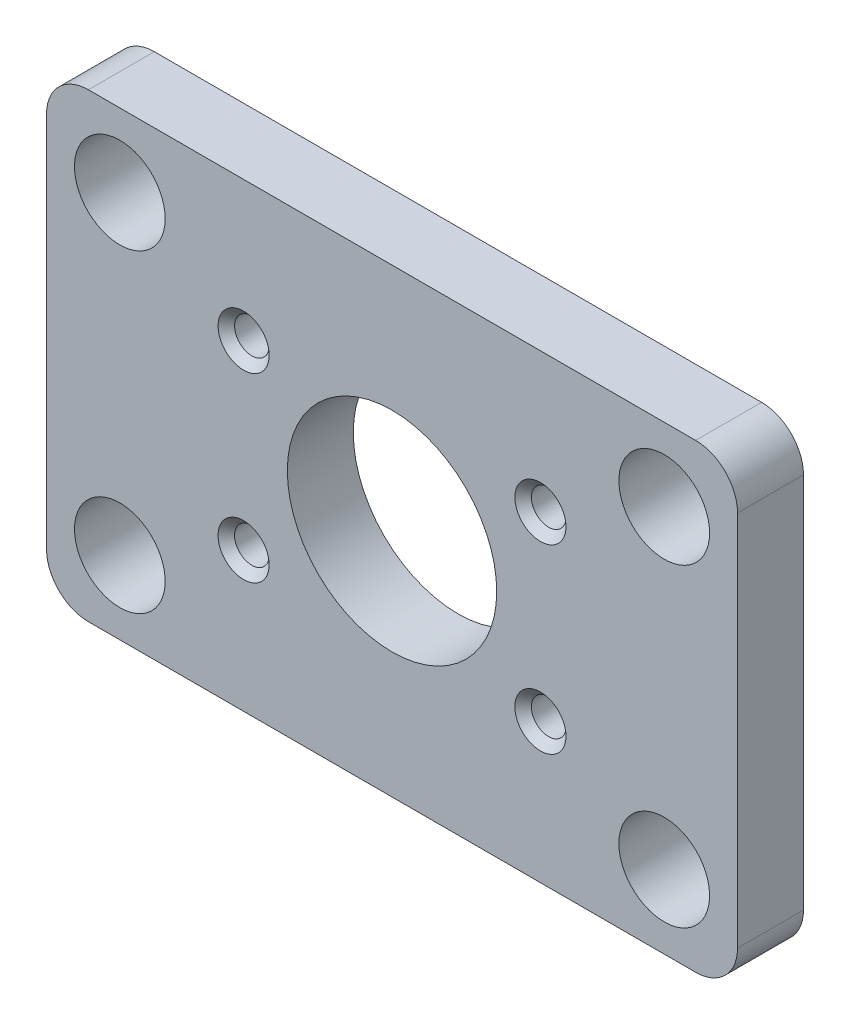
ISO-10303-21;
HEADER;
FILE_DESCRIPTION(('STEP AP214'),'2;1');
FILE_NAME('part.step','',(''),(''),'','','');
FILE_SCHEMA(('AUTOMOTIVE_DESIGN { 1 0 10303 214 1 1 1 1 }'));
ENDSEC;
DATA;
#1=APPLICATION_CONTEXT('core data for automotive mechanical design processes');
#2=APPLICATION_PROTOCOL_DEFINITION('international standard','automotive_design',2000,#1);
#3=PRODUCT_CONTEXT('',#1,'mechanical');
#4=PRODUCT('Part','Part','',(#3));
#5=PRODUCT_RELATED_PRODUCT_CATEGORY('part','',(#4));
#6=PRODUCT_DEFINITION_FORMATION('','',#4);
#7=PRODUCT_DEFINITION_CONTEXT('part definition',#1,'design');
#8=PRODUCT_DEFINITION('design','',#6,#7);
#9=PRODUCT_DEFINITION_SHAPE('','',#8);
#10=(LENGTH_UNIT() NAMED_UNIT(*) SI_UNIT(.MILLI.,.METRE.));
#11=(NAMED_UNIT(*) PLANE_ANGLE_UNIT() SI_UNIT($,.RADIAN.));
#12=(NAMED_UNIT(*) SI_UNIT($,.STERADIAN.) SOLID_ANGLE_UNIT());
#13=UNCERTAINTY_MEASURE_WITH_UNIT(LENGTH_MEASURE(1.E-05),#10,'distance_accuracy_value','');
#14=(GEOMETRIC_REPRESENTATION_CONTEXT(3) GLOBAL_UNCERTAINTY_ASSIGNED_CONTEXT((#13)) GLOBAL_UNIT_ASSIGNED_CONTEXT((#10,
#11,#12)) REPRESENTATION_CONTEXT('',''));
#15=CARTESIAN_POINT('',(0.,0.,0.));
#16=DIRECTION('',(0.,0.,1.));
#17=DIRECTION('',(1.,0.,0.));
#18=AXIS2_PLACEMENT_3D('',#15,#16,#17);
#19=CARTESIAN_POINT('',(0.,0.,4.));
#20=DIRECTION('',(0.,0.,1.));
#21=DIRECTION('',(1.,0.,0.));
#22=AXIS2_PLACEMENT_3D('',#19,#20,#21);
#23=PLANE('',#22);
#24=CARTESIAN_POINT('',(9.00048999999999,-5.50037,4.));
#25=DIRECTION('',(0.,0.,1.));
#26=DIRECTION('',(1.,0.,0.));
#27=AXIS2_PLACEMENT_3D('',#24,#25,#26);
#28=CIRCLE('',#27,1.55000000000002);
#29=CARTESIAN_POINT('',(10.55049,-5.50037,4.));
#30=VERTEX_POINT('',#29);
#31=EDGE_CURVE('E181',#30,#30,#28,.F.);
#32=ORIENTED_EDGE('',*,*,#31,.T.);
#33=EDGE_LOOP('',(#32));
#34=FACE_BOUND('',#33,.T.);
#35=CARTESIAN_POINT('',(9.00048999999999,5.50037,4.));
#36=DIRECTION('',(0.,0.,1.));
#37=DIRECTION('',(1.,0.,0.));
#38=AXIS2_PLACEMENT_3D('',#35,#36,#37);
#39=CIRCLE('',#38,1.55);
#40=CARTESIAN_POINT('',(10.55049,5.50037,4.));
#41=VERTEX_POINT('',#40);
#42=EDGE_CURVE('E178',#41,#41,#39,.F.);
#43=ORIENTED_EDGE('',*,*,#42,.T.);
#44=EDGE_LOOP('',(#43));
#45=FACE_BOUND('',#44,.T.);
#46=CARTESIAN_POINT('',(-9.00049,-5.50037000000001,4.));
#47=DIRECTION('',(0.,0.,1.));
#48=DIRECTION('',(1.,0.,0.));
#49=AXIS2_PLACEMENT_3D('',#46,#47,#48);
#50=CIRCLE('',#49,1.55000000000002);
#51=CARTESIAN_POINT('',(-7.45048999999999,-5.50037000000001,4.));
#52=VERTEX_POINT('',#51);
#53=EDGE_CURVE('E175',#52,#52,#50,.F.);
#54=ORIENTED_EDGE('',*,*,#53,.T.);
#55=EDGE_LOOP('',(#54));
#56=FACE_BOUND('',#55,.T.);
#57=CARTESIAN_POINT('',(-9.00049,5.50037,4.));
#58=DIRECTION('',(0.,0.,1.));
#59=DIRECTION('',(1.,0.,0.));
#60=AXIS2_PLACEMENT_3D('',#57,#58,#59);
#61=CIRCLE('',#60,1.55);
#62=CARTESIAN_POINT('',(-7.45049,5.50037,4.));
#63=VERTEX_POINT('',#62);
#64=EDGE_CURVE('E172',#63,#63,#61,.F.);
#65=ORIENTED_EDGE('',*,*,#64,.T.);
#66=EDGE_LOOP('',(#65));
#67=FACE_BOUND('',#66,.T.);
#68=CARTESIAN_POINT('',(0.,0.,4.));
#69=DIRECTION('',(0.,0.,1.));
#70=DIRECTION('',(1.,0.,0.));
#71=AXIS2_PLACEMENT_3D('',#68,#69,#70);
#72=CIRCLE('',#71,6.35);
#73=CARTESIAN_POINT('',(6.35,0.,4.));
#74=VERTEX_POINT('',#73);
#75=EDGE_CURVE('E329',#74,#74,#72,.T.);
#76=ORIENTED_EDGE('',*,*,#75,.F.);
#77=EDGE_LOOP('',(#76));
#78=FACE_BOUND('',#77,.T.);
#79=CARTESIAN_POINT('',(16.51,-9.525,4.));
#80=DIRECTION('',(0.,0.,1.));
#81=DIRECTION('',(-1.,0.,0.));
#82=AXIS2_PLACEMENT_3D('',#79,#80,#81);
#83=CIRCLE('',#82,2.75);
#84=CARTESIAN_POINT('',(13.76,-9.525,4.));
#85=VERTEX_POINT('',#84);
#86=EDGE_CURVE('E276',#85,#85,#83,.T.);
#87=ORIENTED_EDGE('',*,*,#86,.F.);
#88=EDGE_LOOP('',(#87));
#89=FACE_BOUND('',#88,.T.);
#90=CARTESIAN_POINT('',(16.51,9.525,4.));
#91=DIRECTION('',(0.,0.,1.));
#92=DIRECTION('',(1.,0.,0.));
#93=AXIS2_PLACEMENT_3D('',#90,#91,#92);
#94=CIRCLE('',#93,2.75);
#95=CARTESIAN_POINT('',(19.26,9.525,4.));
#96=VERTEX_POINT('',#95);
#97=EDGE_CURVE('E279',#96,#96,#94,.T.);
#98=ORIENTED_EDGE('',*,*,#97,.F.);
#99=EDGE_LOOP('',(#98));
#100=FACE_BOUND('',#99,.T.);
#101=DIRECTION('',(0.,1.,0.));
#102=VECTOR('',#101,1.);
#103=CARTESIAN_POINT('',(20.955,-13.97,4.));
#104=LINE('',#103,#102);
#105=CARTESIAN_POINT('',(20.955,-11.43,4.));
#106=VERTEX_POINT('',#105);
#107=CARTESIAN_POINT('',(20.955,11.43,4.));
#108=VERTEX_POINT('',#107);
#109=EDGE_CURVE('E296',#106,#108,#104,.T.);
#110=ORIENTED_EDGE('',*,*,#109,.T.);
#111=CARTESIAN_POINT('',(18.415,11.43,4.));
#112=DIRECTION('',(0.,0.,1.));
#113=DIRECTION('',(1.,0.,0.));
#114=AXIS2_PLACEMENT_3D('',#111,#112,#113);
#115=CIRCLE('',#114,2.54);
#116=CARTESIAN_POINT('',(18.415,13.97,4.));
#117=VERTEX_POINT('',#116);
#118=EDGE_CURVE('E158',#108,#117,#115,.T.);
#119=ORIENTED_EDGE('',*,*,#118,.T.);
#120=DIRECTION('',(-1.,0.,0.));
#121=VECTOR('',#120,1.);
#122=CARTESIAN_POINT('',(20.955,13.97,4.));
#123=LINE('',#122,#121);
#124=CARTESIAN_POINT('',(-18.415,13.97,4.));
#125=VERTEX_POINT('',#124);
#126=EDGE_CURVE('E129',#117,#125,#123,.T.);
#127=ORIENTED_EDGE('',*,*,#126,.T.);
#128=CARTESIAN_POINT('',(-18.415,11.43,4.));
#129=DIRECTION('',(0.,0.,1.));
#130=DIRECTION('',(1.,0.,0.));
#131=AXIS2_PLACEMENT_3D('',#128,#129,#130);
#132=CIRCLE('',#131,2.54);
#133=CARTESIAN_POINT('',(-20.955,11.43,4.));
#134=VERTEX_POINT('',#133);
#135=EDGE_CURVE('E153',#125,#134,#132,.T.);
#136=ORIENTED_EDGE('',*,*,#135,.T.);
#137=DIRECTION('',(0.,-1.,0.));
#138=VECTOR('',#137,1.);
#139=CARTESIAN_POINT('',(-20.955,-13.97,4.));
#140=LINE('',#139,#138);
#141=CARTESIAN_POINT('',(-20.955,-11.43,4.));
#142=VERTEX_POINT('',#141);
#143=EDGE_CURVE('E136',#134,#142,#140,.T.);
#144=ORIENTED_EDGE('',*,*,#143,.T.);
#145=CARTESIAN_POINT('',(-18.415,-11.43,4.));
#146=DIRECTION('',(0.,0.,1.));
#147=DIRECTION('',(1.,0.,0.));
#148=AXIS2_PLACEMENT_3D('',#145,#146,#147);
#149=CIRCLE('',#148,2.54);
#150=CARTESIAN_POINT('',(-18.415,-13.97,4.));
#151=VERTEX_POINT('',#150);
#152=EDGE_CURVE('E64',#142,#151,#149,.T.);
#153=ORIENTED_EDGE('',*,*,#152,.T.);
#154=DIRECTION('',(1.,0.,0.));
#155=VECTOR('',#154,1.);
#156=CARTESIAN_POINT('',(20.955,-13.97,4.));
#157=LINE('',#156,#155);
#158=CARTESIAN_POINT('',(18.415,-13.97,4.));
#159=VERTEX_POINT('',#158);
#160=EDGE_CURVE('E139',#151,#159,#157,.T.);
#161=ORIENTED_EDGE('',*,*,#160,.T.);
#162=CARTESIAN_POINT('',(18.415,-11.43,4.));
#163=DIRECTION('',(0.,0.,1.));
#164=DIRECTION('',(1.,0.,0.));
#165=AXIS2_PLACEMENT_3D('',#162,#163,#164);
#166=CIRCLE('',#165,2.54);
#167=EDGE_CURVE('E156',#159,#106,#166,.T.);
#168=ORIENTED_EDGE('',*,*,#167,.T.);
#169=EDGE_LOOP('',(#110,#119,#127,#136,#144,#153,#161,#168));
#170=FACE_BOUND('',#169,.T.);
#171=CARTESIAN_POINT('',(-16.51,9.525,4.));
#172=DIRECTION('',(0.,0.,1.));
#173=DIRECTION('',(1.,0.,0.));
#174=AXIS2_PLACEMENT_3D('',#171,#172,#173);
#175=CIRCLE('',#174,2.75);
#176=CARTESIAN_POINT('',(-13.76,9.525,4.));
#177=VERTEX_POINT('',#176);
#178=EDGE_CURVE('E289',#177,#177,#175,.T.);
#179=ORIENTED_EDGE('',*,*,#178,.F.);
#180=EDGE_LOOP('',(#179));
#181=FACE_BOUND('',#180,.T.);
#182=CARTESIAN_POINT('',(-16.51,-9.525,4.));
#183=DIRECTION('',(0.,0.,1.));
#184=DIRECTION('',(-1.,0.,0.));
#185=AXIS2_PLACEMENT_3D('',#182,#183,#184);
#186=CIRCLE('',#185,2.75);
#187=CARTESIAN_POINT('',(-19.26,-9.525,4.));
#188=VERTEX_POINT('',#187);
#189=EDGE_CURVE('E315',#188,#188,#186,.T.);
#190=ORIENTED_EDGE('',*,*,#189,.F.);
#191=EDGE_LOOP('',(#190));
#192=FACE_BOUND('',#191,.T.);
#193=ADVANCED_FACE('F41',(#34,#45,#56,#67,#78,#89,#100,#170,#181,#192),#23,.T.);
#194=CARTESIAN_POINT('',(0.,0.,0.));
#195=DIRECTION('',(0.,0.,1.));
#196=DIRECTION('',(1.,0.,0.));
#197=AXIS2_PLACEMENT_3D('',#194,#195,#196);
#198=PLANE('',#197);
#199=DIRECTION('',(-1.,0.,0.));
#200=VECTOR('',#199,1.);
#201=CARTESIAN_POINT('',(20.955,13.97,0.));
#202=LINE('',#201,#200);
#203=CARTESIAN_POINT('',(18.415,13.97,0.));
#204=VERTEX_POINT('',#203);
#205=CARTESIAN_POINT('',(-18.415,13.97,0.));
#206=VERTEX_POINT('',#205);
#207=EDGE_CURVE('E126',#204,#206,#202,.T.);
#208=ORIENTED_EDGE('',*,*,#207,.F.);
#209=CARTESIAN_POINT('',(18.415,11.43,0.));
#210=DIRECTION('',(0.,0.,1.));
#211=DIRECTION('',(1.,0.,0.));
#212=AXIS2_PLACEMENT_3D('',#209,#210,#211);
#213=CIRCLE('',#212,2.54);
#214=CARTESIAN_POINT('',(20.955,11.43,0.));
#215=VERTEX_POINT('',#214);
#216=EDGE_CURVE('E109',#204,#215,#213,.F.);
#217=ORIENTED_EDGE('',*,*,#216,.T.);
#218=DIRECTION('',(0.,1.,0.));
#219=VECTOR('',#218,1.);
#220=CARTESIAN_POINT('',(20.955,-13.97,0.));
#221=LINE('',#220,#219);
#222=CARTESIAN_POINT('',(20.955,-11.43,0.));
#223=VERTEX_POINT('',#222);
#224=EDGE_CURVE('E137',#223,#215,#221,.T.);
#225=ORIENTED_EDGE('',*,*,#224,.F.);
#226=CARTESIAN_POINT('',(18.415,-11.43,0.));
#227=DIRECTION('',(0.,0.,1.));
#228=DIRECTION('',(1.,0.,0.));
#229=AXIS2_PLACEMENT_3D('',#226,#227,#228);
#230=CIRCLE('',#229,2.54);
#231=CARTESIAN_POINT('',(18.415,-13.97,0.));
#232=VERTEX_POINT('',#231);
#233=EDGE_CURVE('E120',#223,#232,#230,.F.);
#234=ORIENTED_EDGE('',*,*,#233,.T.);
#235=DIRECTION('',(1.,0.,0.));
#236=VECTOR('',#235,1.);
#237=CARTESIAN_POINT('',(20.955,-13.97,0.));
#238=LINE('',#237,#236);
#239=CARTESIAN_POINT('',(-18.415,-13.97,0.));
#240=VERTEX_POINT('',#239);
#241=EDGE_CURVE('E141',#240,#232,#238,.T.);
#242=ORIENTED_EDGE('',*,*,#241,.F.);
#243=CARTESIAN_POINT('',(-18.415,-11.43,0.));
#244=DIRECTION('',(0.,0.,1.));
#245=DIRECTION('',(1.,0.,0.));
#246=AXIS2_PLACEMENT_3D('',#243,#244,#245);
#247=CIRCLE('',#246,2.54);
#248=CARTESIAN_POINT('',(-20.955,-11.43,0.));
#249=VERTEX_POINT('',#248);
#250=EDGE_CURVE('E147',#240,#249,#247,.F.);
#251=ORIENTED_EDGE('',*,*,#250,.T.);
#252=DIRECTION('',(0.,-1.,0.));
#253=VECTOR('',#252,1.);
#254=CARTESIAN_POINT('',(-20.955,-13.97,0.));
#255=LINE('',#254,#253);
#256=CARTESIAN_POINT('',(-20.955,11.43,0.));
#257=VERTEX_POINT('',#256);
#258=EDGE_CURVE('E292',#257,#249,#255,.T.);
#259=ORIENTED_EDGE('',*,*,#258,.F.);
#260=CARTESIAN_POINT('',(-18.415,11.43,0.));
#261=DIRECTION('',(0.,0.,1.));
#262=DIRECTION('',(1.,0.,0.));
#263=AXIS2_PLACEMENT_3D('',#260,#261,#262);
#264=CIRCLE('',#263,2.54);
#265=EDGE_CURVE('E130',#257,#206,#264,.F.);
#266=ORIENTED_EDGE('',*,*,#265,.T.);
#267=EDGE_LOOP('',(#208,#217,#225,#234,#242,#251,#259,#266));
#268=FACE_BOUND('',#267,.T.);
#269=CARTESIAN_POINT('',(-16.51,9.525,0.));
#270=DIRECTION('',(0.,0.,1.));
#271=DIRECTION('',(1.,0.,0.));
#272=AXIS2_PLACEMENT_3D('',#269,#270,#271);
#273=CIRCLE('',#272,2.75);
#274=CARTESIAN_POINT('',(-13.76,9.525,0.));
#275=VERTEX_POINT('',#274);
#276=EDGE_CURVE('E287',#275,#275,#273,.T.);
#277=ORIENTED_EDGE('',*,*,#276,.T.);
#278=EDGE_LOOP('',(#277));
#279=FACE_BOUND('',#278,.T.);
#280=CARTESIAN_POINT('',(16.51,9.525,0.));
#281=DIRECTION('',(0.,0.,1.));
#282=DIRECTION('',(1.,0.,0.));
#283=AXIS2_PLACEMENT_3D('',#280,#281,#282);
#284=CIRCLE('',#283,2.75);
#285=CARTESIAN_POINT('',(19.26,9.525,0.));
#286=VERTEX_POINT('',#285);
#287=EDGE_CURVE('E275',#286,#286,#284,.T.);
#288=ORIENTED_EDGE('',*,*,#287,.T.);
#289=EDGE_LOOP('',(#288));
#290=FACE_BOUND('',#289,.T.);
#291=CARTESIAN_POINT('',(9.00048999999999,-5.50037,0.));
#292=DIRECTION('',(0.,0.,1.));
#293=DIRECTION('',(1.,0.,0.));
#294=AXIS2_PLACEMENT_3D('',#291,#292,#293);
#295=CIRCLE('',#294,1.05);
#296=CARTESIAN_POINT('',(10.05049,-5.50037,0.));
#297=VERTEX_POINT('',#296);
#298=EDGE_CURVE('E273',#297,#297,#295,.T.);
#299=ORIENTED_EDGE('',*,*,#298,.T.);
#300=EDGE_LOOP('',(#299));
#301=FACE_BOUND('',#300,.T.);
#302=CARTESIAN_POINT('',(16.51,-9.525,0.));
#303=DIRECTION('',(0.,0.,1.));
#304=DIRECTION('',(-1.,0.,0.));
#305=AXIS2_PLACEMENT_3D('',#302,#303,#304);
#306=CIRCLE('',#305,2.75);
#307=CARTESIAN_POINT('',(13.76,-9.525,0.));
#308=VERTEX_POINT('',#307);
#309=EDGE_CURVE('E282',#308,#308,#306,.T.);
#310=ORIENTED_EDGE('',*,*,#309,.T.);
#311=EDGE_LOOP('',(#310));
#312=FACE_BOUND('',#311,.T.);
#313=CARTESIAN_POINT('',(-16.51,-9.525,0.));
#314=DIRECTION('',(0.,0.,1.));
#315=DIRECTION('',(-1.,0.,0.));
#316=AXIS2_PLACEMENT_3D('',#313,#314,#315);
#317=CIRCLE('',#316,2.75);
#318=CARTESIAN_POINT('',(-19.26,-9.525,0.));
#319=VERTEX_POINT('',#318);
#320=EDGE_CURVE('E317',#319,#319,#317,.T.);
#321=ORIENTED_EDGE('',*,*,#320,.T.);
#322=EDGE_LOOP('',(#321));
#323=FACE_BOUND('',#322,.T.);
#324=CARTESIAN_POINT('',(-9.00049,5.50037,0.));
#325=DIRECTION('',(0.,0.,1.));
#326=DIRECTION('',(1.,0.,0.));
#327=AXIS2_PLACEMENT_3D('',#324,#325,#326);
#328=CIRCLE('',#327,1.05);
#329=CARTESIAN_POINT('',(-7.95049,5.50037,0.));
#330=VERTEX_POINT('',#329);
#331=EDGE_CURVE('E321',#330,#330,#328,.T.);
#332=ORIENTED_EDGE('',*,*,#331,.T.);
#333=EDGE_LOOP('',(#332));
#334=FACE_BOUND('',#333,.T.);
#335=CARTESIAN_POINT('',(-9.00049,-5.50037000000001,0.));
#336=DIRECTION('',(0.,0.,1.));
#337=DIRECTION('',(-1.,0.,0.));
#338=AXIS2_PLACEMENT_3D('',#335,#336,#337);
#339=CIRCLE('',#338,1.05);
#340=CARTESIAN_POINT('',(-10.05049,-5.50037000000001,0.));
#341=VERTEX_POINT('',#340);
#342=EDGE_CURVE('E326',#341,#341,#339,.T.);
#343=ORIENTED_EDGE('',*,*,#342,.T.);
#344=EDGE_LOOP('',(#343));
#345=FACE_BOUND('',#344,.T.);
#346=CARTESIAN_POINT('',(0.,0.,0.));
#347=DIRECTION('',(0.,0.,1.));
#348=DIRECTION('',(1.,0.,0.));
#349=AXIS2_PLACEMENT_3D('',#346,#347,#348);
#350=CIRCLE('',#349,6.35);
#351=CARTESIAN_POINT('',(6.35,0.,0.));
#352=VERTEX_POINT('',#351);
#353=EDGE_CURVE('E330',#352,#352,#350,.T.);
#354=ORIENTED_EDGE('',*,*,#353,.T.);
#355=EDGE_LOOP('',(#354));
#356=FACE_BOUND('',#355,.T.);
#357=CARTESIAN_POINT('',(9.00048999999999,5.50037,0.));
#358=DIRECTION('',(0.,0.,1.));
#359=DIRECTION('',(-1.,0.,0.));
#360=AXIS2_PLACEMENT_3D('',#357,#358,#359);
#361=CIRCLE('',#360,1.04999999999999);
#362=CARTESIAN_POINT('',(7.95049000000001,5.50037,0.));
#363=VERTEX_POINT('',#362);
#364=EDGE_CURVE('E333',#363,#363,#361,.T.);
#365=ORIENTED_EDGE('',*,*,#364,.T.);
#366=EDGE_LOOP('',(#365));
#367=FACE_BOUND('',#366,.T.);
#368=ADVANCED_FACE('F133',(#268,#279,#290,#301,#312,#323,#334,#345,#356,#367),#198,.F.);
#369=CARTESIAN_POINT('',(-20.955,-13.97,4.));
#370=DIRECTION('',(1.,0.,0.));
#371=DIRECTION('',(0.,0.,-1.));
#372=AXIS2_PLACEMENT_3D('',#369,#370,#371);
#373=PLANE('',#372);
#374=ORIENTED_EDGE('',*,*,#258,.T.);
#375=DIRECTION('',(0.,0.,-1.));
#376=VECTOR('',#375,1.);
#377=CARTESIAN_POINT('',(-20.955,-11.43,4.));
#378=LINE('',#377,#376);
#379=EDGE_CURVE('E167',#249,#142,#378,.F.);
#380=ORIENTED_EDGE('',*,*,#379,.T.);
#381=ORIENTED_EDGE('',*,*,#143,.F.);
#382=DIRECTION('',(0.,0.,-1.));
#383=VECTOR('',#382,1.);
#384=CARTESIAN_POINT('',(-20.955,11.43,4.));
#385=LINE('',#384,#383);
#386=EDGE_CURVE('E164',#134,#257,#385,.T.);
#387=ORIENTED_EDGE('',*,*,#386,.T.);
#388=EDGE_LOOP('',(#374,#380,#381,#387));
#389=FACE_BOUND('',#388,.T.);
#390=ADVANCED_FACE('F214',(#389),#373,.F.);
#391=CARTESIAN_POINT('',(20.955,-13.97,4.));
#392=DIRECTION('',(0.,1.,0.));
#393=DIRECTION('',(-1.,0.,0.));
#394=AXIS2_PLACEMENT_3D('',#391,#392,#393);
#395=PLANE('',#394);
#396=ORIENTED_EDGE('',*,*,#241,.T.);
#397=DIRECTION('',(0.,0.,-1.));
#398=VECTOR('',#397,1.);
#399=CARTESIAN_POINT('',(18.415,-13.97,4.));
#400=LINE('',#399,#398);
#401=EDGE_CURVE('E57',#232,#159,#400,.F.);
#402=ORIENTED_EDGE('',*,*,#401,.T.);
#403=ORIENTED_EDGE('',*,*,#160,.F.);
#404=DIRECTION('',(0.,0.,-1.));
#405=VECTOR('',#404,1.);
#406=CARTESIAN_POINT('',(-18.415,-13.97,4.));
#407=LINE('',#406,#405);
#408=EDGE_CURVE('E160',#151,#240,#407,.T.);
#409=ORIENTED_EDGE('',*,*,#408,.T.);
#410=EDGE_LOOP('',(#396,#402,#403,#409));
#411=FACE_BOUND('',#410,.T.);
#412=ADVANCED_FACE('F226',(#411),#395,.F.);
#413=CARTESIAN_POINT('',(20.955,-13.97,4.));
#414=DIRECTION('',(-1.,0.,0.));
#415=DIRECTION('',(0.,0.,1.));
#416=AXIS2_PLACEMENT_3D('',#413,#414,#415);
#417=PLANE('',#416);
#418=ORIENTED_EDGE('',*,*,#224,.T.);
#419=DIRECTION('',(0.,0.,-1.));
#420=VECTOR('',#419,1.);
#421=CARTESIAN_POINT('',(20.955,11.43,4.));
#422=LINE('',#421,#420);
#423=EDGE_CURVE('E114',#215,#108,#422,.F.);
#424=ORIENTED_EDGE('',*,*,#423,.T.);
#425=ORIENTED_EDGE('',*,*,#109,.F.);
#426=DIRECTION('',(0.,0.,-1.));
#427=VECTOR('',#426,1.);
#428=CARTESIAN_POINT('',(20.955,-11.43,4.));
#429=LINE('',#428,#427);
#430=EDGE_CURVE('E119',#106,#223,#429,.T.);
#431=ORIENTED_EDGE('',*,*,#430,.T.);
#432=EDGE_LOOP('',(#418,#424,#425,#431));
#433=FACE_BOUND('',#432,.T.);
#434=ADVANCED_FACE('F223',(#433),#417,.F.);
#435=CARTESIAN_POINT('',(20.955,13.97,4.));
#436=DIRECTION('',(0.,-1.,0.));
#437=DIRECTION('',(1.,0.,0.));
#438=AXIS2_PLACEMENT_3D('',#435,#436,#437);
#439=PLANE('',#438);
#440=ORIENTED_EDGE('',*,*,#126,.F.);
#441=DIRECTION('',(0.,0.,-1.));
#442=VECTOR('',#441,1.);
#443=CARTESIAN_POINT('',(18.415,13.97,4.));
#444=LINE('',#443,#442);
#445=EDGE_CURVE('E113',#117,#204,#444,.T.);
#446=ORIENTED_EDGE('',*,*,#445,.T.);
#447=ORIENTED_EDGE('',*,*,#207,.T.);
#448=DIRECTION('',(0.,0.,-1.));
#449=VECTOR('',#448,1.);
#450=CARTESIAN_POINT('',(-18.415,13.97,4.));
#451=LINE('',#450,#449);
#452=EDGE_CURVE('E131',#206,#125,#451,.F.);
#453=ORIENTED_EDGE('',*,*,#452,.T.);
#454=EDGE_LOOP('',(#440,#446,#447,#453));
#455=FACE_BOUND('',#454,.T.);
#456=ADVANCED_FACE('F125',(#455),#439,.F.);
#457=CARTESIAN_POINT('',(-16.51,9.525,4.));
#458=DIRECTION('',(0.,0.,-1.));
#459=DIRECTION('',(-1.,0.,0.));
#460=AXIS2_PLACEMENT_3D('',#457,#458,#459);
#461=CYLINDRICAL_SURFACE('',#460,2.75);
#462=ORIENTED_EDGE('',*,*,#178,.T.);
#463=EDGE_LOOP('',(#462));
#464=FACE_BOUND('',#463,.T.);
#465=ORIENTED_EDGE('',*,*,#276,.F.);
#466=EDGE_LOOP('',(#465));
#467=FACE_BOUND('',#466,.T.);
#468=ADVANCED_FACE('F218',(#464,#467),#461,.F.);
#469=CARTESIAN_POINT('',(16.51,9.525,4.));
#470=DIRECTION('',(0.,0.,-1.));
#471=DIRECTION('',(-1.,0.,0.));
#472=AXIS2_PLACEMENT_3D('',#469,#470,#471);
#473=CYLINDRICAL_SURFACE('',#472,2.75);
#474=ORIENTED_EDGE('',*,*,#97,.T.);
#475=EDGE_LOOP('',(#474));
#476=FACE_BOUND('',#475,.T.);
#477=ORIENTED_EDGE('',*,*,#287,.F.);
#478=EDGE_LOOP('',(#477));
#479=FACE_BOUND('',#478,.T.);
#480=ADVANCED_FACE('F269',(#476,#479),#473,.F.);
#481=CARTESIAN_POINT('',(9.00048999999999,-5.50037,4.));
#482=DIRECTION('',(0.,0.,-1.));
#483=DIRECTION('',(-1.,0.,0.));
#484=AXIS2_PLACEMENT_3D('',#481,#482,#483);
#485=CYLINDRICAL_SURFACE('',#484,1.05);
#486=CARTESIAN_POINT('',(9.00048999999999,-5.50037,3.49999999999999));
#487=DIRECTION('',(0.,0.,1.));
#488=DIRECTION('',(1.,0.,0.));
#489=AXIS2_PLACEMENT_3D('',#486,#487,#488);
#490=CIRCLE('',#489,1.05);
#491=CARTESIAN_POINT('',(10.05049,-5.50037,3.49999999999999));
#492=VERTEX_POINT('',#491);
#493=EDGE_CURVE('E169',#492,#492,#490,.T.);
#494=ORIENTED_EDGE('',*,*,#493,.T.);
#495=EDGE_LOOP('',(#494));
#496=FACE_BOUND('',#495,.T.);
#497=ORIENTED_EDGE('',*,*,#298,.F.);
#498=EDGE_LOOP('',(#497));
#499=FACE_BOUND('',#498,.T.);
#500=ADVANCED_FACE('F266',(#496,#499),#485,.F.);
#501=CARTESIAN_POINT('',(16.51,-9.525,4.));
#502=DIRECTION('',(0.,0.,-1.));
#503=DIRECTION('',(-1.,0.,0.));
#504=AXIS2_PLACEMENT_3D('',#501,#502,#503);
#505=CYLINDRICAL_SURFACE('',#504,2.75);
#506=ORIENTED_EDGE('',*,*,#86,.T.);
#507=EDGE_LOOP('',(#506));
#508=FACE_BOUND('',#507,.T.);
#509=ORIENTED_EDGE('',*,*,#309,.F.);
#510=EDGE_LOOP('',(#509));
#511=FACE_BOUND('',#510,.T.);
#512=ADVANCED_FACE('F268',(#508,#511),#505,.F.);
#513=CARTESIAN_POINT('',(-16.51,-9.525,4.));
#514=DIRECTION('',(0.,0.,-1.));
#515=DIRECTION('',(-1.,0.,0.));
#516=AXIS2_PLACEMENT_3D('',#513,#514,#515);
#517=CYLINDRICAL_SURFACE('',#516,2.75);
#518=ORIENTED_EDGE('',*,*,#189,.T.);
#519=EDGE_LOOP('',(#518));
#520=FACE_BOUND('',#519,.T.);
#521=ORIENTED_EDGE('',*,*,#320,.F.);
#522=EDGE_LOOP('',(#521));
#523=FACE_BOUND('',#522,.T.);
#524=ADVANCED_FACE('F354',(#520,#523),#517,.F.);
#525=CARTESIAN_POINT('',(-9.00049,5.50037,4.));
#526=DIRECTION('',(0.,0.,-1.));
#527=DIRECTION('',(-1.,0.,0.));
#528=AXIS2_PLACEMENT_3D('',#525,#526,#527);
#529=CYLINDRICAL_SURFACE('',#528,1.05);
#530=CARTESIAN_POINT('',(-9.00049,5.50037,3.49999999999999));
#531=DIRECTION('',(0.,0.,1.));
#532=DIRECTION('',(1.,0.,0.));
#533=AXIS2_PLACEMENT_3D('',#530,#531,#532);
#534=CIRCLE('',#533,1.05);
#535=CARTESIAN_POINT('',(-7.95049,5.50037,3.49999999999999));
#536=VERTEX_POINT('',#535);
#537=EDGE_CURVE('E11',#536,#536,#534,.T.);
#538=ORIENTED_EDGE('',*,*,#537,.T.);
#539=EDGE_LOOP('',(#538));
#540=FACE_BOUND('',#539,.T.);
#541=ORIENTED_EDGE('',*,*,#331,.F.);
#542=EDGE_LOOP('',(#541));
#543=FACE_BOUND('',#542,.T.);
#544=ADVANCED_FACE('F351',(#540,#543),#529,.F.);
#545=CARTESIAN_POINT('',(-9.00049,-5.50037000000001,4.));
#546=DIRECTION('',(0.,0.,-1.));
#547=DIRECTION('',(-1.,0.,0.));
#548=AXIS2_PLACEMENT_3D('',#545,#546,#547);
#549=CYLINDRICAL_SURFACE('',#548,1.05);
#550=CARTESIAN_POINT('',(-9.00049,-5.50037000000001,3.49999999999999));
#551=DIRECTION('',(0.,0.,1.));
#552=DIRECTION('',(1.,0.,0.));
#553=AXIS2_PLACEMENT_3D('',#550,#551,#552);
#554=CIRCLE('',#553,1.05);
#555=CARTESIAN_POINT('',(-7.95049,-5.50037000000001,3.49999999999999));
#556=VERTEX_POINT('',#555);
#557=EDGE_CURVE('E50',#556,#556,#554,.T.);
#558=ORIENTED_EDGE('',*,*,#557,.T.);
#559=EDGE_LOOP('',(#558));
#560=FACE_BOUND('',#559,.T.);
#561=ORIENTED_EDGE('',*,*,#342,.F.);
#562=EDGE_LOOP('',(#561));
#563=FACE_BOUND('',#562,.T.);
#564=ADVANCED_FACE('F189',(#560,#563),#549,.F.);
#565=CARTESIAN_POINT('',(0.,0.,4.));
#566=DIRECTION('',(0.,0.,-1.));
#567=DIRECTION('',(-1.,0.,0.));
#568=AXIS2_PLACEMENT_3D('',#565,#566,#567);
#569=CYLINDRICAL_SURFACE('',#568,6.35);
#570=ORIENTED_EDGE('',*,*,#75,.T.);
#571=EDGE_LOOP('',(#570));
#572=FACE_BOUND('',#571,.T.);
#573=ORIENTED_EDGE('',*,*,#353,.F.);
#574=EDGE_LOOP('',(#573));
#575=FACE_BOUND('',#574,.T.);
#576=ADVANCED_FACE('F340',(#572,#575),#569,.F.);
#577=CARTESIAN_POINT('',(9.00048999999999,5.50037,4.));
#578=DIRECTION('',(0.,0.,-1.));
#579=DIRECTION('',(-1.,0.,0.));
#580=AXIS2_PLACEMENT_3D('',#577,#578,#579);
#581=CYLINDRICAL_SURFACE('',#580,1.04999999999999);
#582=CARTESIAN_POINT('',(9.00048999999999,5.50037,3.49999999999999));
#583=DIRECTION('',(0.,0.,1.));
#584=DIRECTION('',(1.,0.,0.));
#585=AXIS2_PLACEMENT_3D('',#582,#583,#584);
#586=CIRCLE('',#585,1.04999999999999);
#587=CARTESIAN_POINT('',(10.05049,5.50037,3.49999999999999));
#588=VERTEX_POINT('',#587);
#589=EDGE_CURVE('E184',#588,#588,#586,.T.);
#590=ORIENTED_EDGE('',*,*,#589,.T.);
#591=EDGE_LOOP('',(#590));
#592=FACE_BOUND('',#591,.T.);
#593=ORIENTED_EDGE('',*,*,#364,.F.);
#594=EDGE_LOOP('',(#593));
#595=FACE_BOUND('',#594,.T.);
#596=ADVANCED_FACE('F236',(#592,#595),#581,.F.);
#597=CARTESIAN_POINT('',(18.415,11.43,4.));
#598=DIRECTION('',(0.,0.,-1.));
#599=DIRECTION('',(-1.,0.,0.));
#600=AXIS2_PLACEMENT_3D('',#597,#598,#599);
#601=CYLINDRICAL_SURFACE('',#600,2.54);
#602=ORIENTED_EDGE('',*,*,#118,.F.);
#603=ORIENTED_EDGE('',*,*,#423,.F.);
#604=ORIENTED_EDGE('',*,*,#216,.F.);
#605=ORIENTED_EDGE('',*,*,#445,.F.);
#606=EDGE_LOOP('',(#602,#603,#604,#605));
#607=FACE_BOUND('',#606,.T.);
#608=ADVANCED_FACE('F112',(#607),#601,.T.);
#609=CARTESIAN_POINT('',(18.415,-11.43,4.));
#610=DIRECTION('',(0.,0.,-1.));
#611=DIRECTION('',(-1.,0.,0.));
#612=AXIS2_PLACEMENT_3D('',#609,#610,#611);
#613=CYLINDRICAL_SURFACE('',#612,2.54);
#614=ORIENTED_EDGE('',*,*,#167,.F.);
#615=ORIENTED_EDGE('',*,*,#401,.F.);
#616=ORIENTED_EDGE('',*,*,#233,.F.);
#617=ORIENTED_EDGE('',*,*,#430,.F.);
#618=EDGE_LOOP('',(#614,#615,#616,#617));
#619=FACE_BOUND('',#618,.T.);
#620=ADVANCED_FACE('F235',(#619),#613,.T.);
#621=CARTESIAN_POINT('',(-18.415,-11.43,4.));
#622=DIRECTION('',(0.,0.,-1.));
#623=DIRECTION('',(-1.,0.,0.));
#624=AXIS2_PLACEMENT_3D('',#621,#622,#623);
#625=CYLINDRICAL_SURFACE('',#624,2.54);
#626=ORIENTED_EDGE('',*,*,#152,.F.);
#627=ORIENTED_EDGE('',*,*,#379,.F.);
#628=ORIENTED_EDGE('',*,*,#250,.F.);
#629=ORIENTED_EDGE('',*,*,#408,.F.);
#630=EDGE_LOOP('',(#626,#627,#628,#629));
#631=FACE_BOUND('',#630,.T.);
#632=ADVANCED_FACE('F239',(#631),#625,.T.);
#633=CARTESIAN_POINT('',(-18.415,11.43,4.));
#634=DIRECTION('',(0.,0.,-1.));
#635=DIRECTION('',(-1.,0.,0.));
#636=AXIS2_PLACEMENT_3D('',#633,#634,#635);
#637=CYLINDRICAL_SURFACE('',#636,2.54);
#638=ORIENTED_EDGE('',*,*,#135,.F.);
#639=ORIENTED_EDGE('',*,*,#452,.F.);
#640=ORIENTED_EDGE('',*,*,#265,.F.);
#641=ORIENTED_EDGE('',*,*,#386,.F.);
#642=EDGE_LOOP('',(#638,#639,#640,#641));
#643=FACE_BOUND('',#642,.T.);
#644=ADVANCED_FACE('F243',(#643),#637,.T.);
#645=CARTESIAN_POINT('',(9.00048999999999,-5.50037,3.49999999999999));
#646=DIRECTION('',(0.,0.,1.));
#647=DIRECTION('',(1.,0.,0.));
#648=AXIS2_PLACEMENT_3D('',#645,#646,#647);
#649=CONICAL_SURFACE('',#648,1.05,0.785398163397452);
#650=ORIENTED_EDGE('',*,*,#31,.F.);
#651=EDGE_LOOP('',(#650));
#652=FACE_BOUND('',#651,.T.);
#653=ORIENTED_EDGE('',*,*,#493,.F.);
#654=EDGE_LOOP('',(#653));
#655=FACE_BOUND('',#654,.T.);
#656=ADVANCED_FACE('F201',(#652,#655),#649,.F.);
#657=CARTESIAN_POINT('',(9.00048999999999,5.50037,3.49999999999999));
#658=DIRECTION('',(0.,0.,1.));
#659=DIRECTION('',(1.,0.,0.));
#660=AXIS2_PLACEMENT_3D('',#657,#658,#659);
#661=CONICAL_SURFACE('',#660,1.04999999999999,0.785398163397452);
#662=ORIENTED_EDGE('',*,*,#42,.F.);
#663=EDGE_LOOP('',(#662));
#664=FACE_BOUND('',#663,.T.);
#665=ORIENTED_EDGE('',*,*,#589,.F.);
#666=EDGE_LOOP('',(#665));
#667=FACE_BOUND('',#666,.T.);
#668=ADVANCED_FACE('F194',(#664,#667),#661,.F.);
#669=CARTESIAN_POINT('',(-9.00049,-5.50037000000001,3.49999999999999));
#670=DIRECTION('',(0.,0.,1.));
#671=DIRECTION('',(1.,0.,0.));
#672=AXIS2_PLACEMENT_3D('',#669,#670,#671);
#673=CONICAL_SURFACE('',#672,1.05,0.785398163397452);
#674=ORIENTED_EDGE('',*,*,#53,.F.);
#675=EDGE_LOOP('',(#674));
#676=FACE_BOUND('',#675,.T.);
#677=ORIENTED_EDGE('',*,*,#557,.F.);
#678=EDGE_LOOP('',(#677));
#679=FACE_BOUND('',#678,.T.);
#680=ADVANCED_FACE('F192',(#676,#679),#673,.F.);
#681=CARTESIAN_POINT('',(-9.00049,5.50037,3.49999999999999));
#682=DIRECTION('',(0.,0.,1.));
#683=DIRECTION('',(1.,0.,0.));
#684=AXIS2_PLACEMENT_3D('',#681,#682,#683);
#685=CONICAL_SURFACE('',#684,1.05,0.785398163397445);
#686=ORIENTED_EDGE('',*,*,#64,.F.);
#687=EDGE_LOOP('',(#686));
#688=FACE_BOUND('',#687,.T.);
#689=ORIENTED_EDGE('',*,*,#537,.F.);
#690=EDGE_LOOP('',(#689));
#691=FACE_BOUND('',#690,.T.);
#692=ADVANCED_FACE('F44',(#688,#691),#685,.F.);
#693=CLOSED_SHELL('',(#193,#368,#390,#412,#434,#456,#468,#480,#500,#512,#524,#544,#564,#576,
#596,#608,#620,#632,#644,#656,#668,#680,#692));
#694=MANIFOLD_SOLID_BREP('B2',#693);
#695=ADVANCED_BREP_SHAPE_REPRESENTATION('',(#18,#694),#14);
#696=SHAPE_DEFINITION_REPRESENTATION(#9,#695);
ENDSEC;
END-ISO-10303-21;
